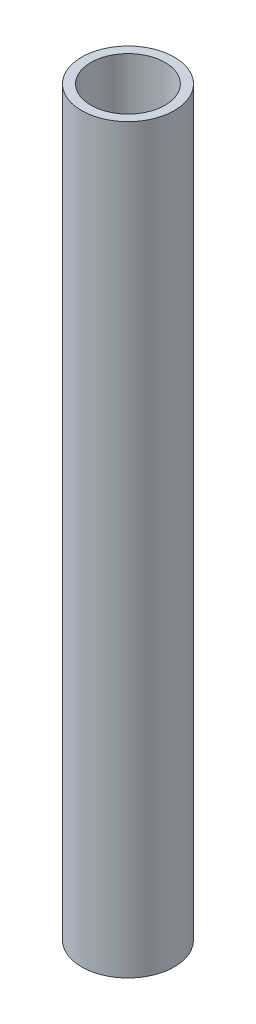
ISO-10303-21;
HEADER;
FILE_DESCRIPTION(('STEP AP214'),'2;1');
FILE_NAME('part.step','',(''),(''),'','','');
FILE_SCHEMA(('AUTOMOTIVE_DESIGN { 1 0 10303 214 1 1 1 1 }'));
ENDSEC;
DATA;
#1=APPLICATION_CONTEXT('core data for automotive mechanical design processes');
#2=APPLICATION_PROTOCOL_DEFINITION('international standard','automotive_design',2000,#1);
#3=PRODUCT_CONTEXT('',#1,'mechanical');
#4=PRODUCT('Part','Part','',(#3));
#5=PRODUCT_RELATED_PRODUCT_CATEGORY('part','',(#4));
#6=PRODUCT_DEFINITION_FORMATION('','',#4);
#7=PRODUCT_DEFINITION_CONTEXT('part definition',#1,'design');
#8=PRODUCT_DEFINITION('design','',#6,#7);
#9=PRODUCT_DEFINITION_SHAPE('','',#8);
#10=(LENGTH_UNIT() NAMED_UNIT(*) SI_UNIT(.MILLI.,.METRE.));
#11=(NAMED_UNIT(*) PLANE_ANGLE_UNIT() SI_UNIT($,.RADIAN.));
#12=(NAMED_UNIT(*) SI_UNIT($,.STERADIAN.) SOLID_ANGLE_UNIT());
#13=UNCERTAINTY_MEASURE_WITH_UNIT(LENGTH_MEASURE(1.E-05),#10,'distance_accuracy_value','');
#14=(GEOMETRIC_REPRESENTATION_CONTEXT(3) GLOBAL_UNCERTAINTY_ASSIGNED_CONTEXT((#13)) GLOBAL_UNIT_ASSIGNED_CONTEXT((#10,
#11,#12)) REPRESENTATION_CONTEXT('',''));
#15=CARTESIAN_POINT('',(0.,0.,0.));
#16=DIRECTION('',(0.,0.,1.));
#17=DIRECTION('',(1.,0.,0.));
#18=AXIS2_PLACEMENT_3D('',#15,#16,#17);
#19=CARTESIAN_POINT('',(0.,40.,0.));
#20=DIRECTION('',(0.,1.,0.));
#21=DIRECTION('',(0.,0.,1.));
#22=AXIS2_PLACEMENT_3D('',#19,#20,#21);
#23=PLANE('',#22);
#24=CARTESIAN_POINT('',(0.,40.,0.));
#25=DIRECTION('',(0.,1.,0.));
#26=DIRECTION('',(0.,0.,1.));
#27=AXIS2_PLACEMENT_3D('',#24,#25,#26);
#28=CIRCLE('',#27,5.);
#29=CARTESIAN_POINT('',(0.,40.,5.));
#30=VERTEX_POINT('',#29);
#31=EDGE_CURVE('E10',#30,#30,#28,.T.);
#32=ORIENTED_EDGE('',*,*,#31,.T.);
#33=EDGE_LOOP('',(#32));
#34=FACE_BOUND('',#33,.T.);
#35=CARTESIAN_POINT('',(0.,40.,0.));
#36=DIRECTION('',(0.,1.,0.));
#37=DIRECTION('',(0.,0.,1.));
#38=AXIS2_PLACEMENT_3D('',#35,#36,#37);
#39=CIRCLE('',#38,4.);
#40=CARTESIAN_POINT('',(0.,40.,4.));
#41=VERTEX_POINT('',#40);
#42=EDGE_CURVE('E42',#41,#41,#39,.T.);
#43=ORIENTED_EDGE('',*,*,#42,.F.);
#44=EDGE_LOOP('',(#43));
#45=FACE_BOUND('',#44,.T.);
#46=ADVANCED_FACE('F31',(#34,#45),#23,.T.);
#47=CARTESIAN_POINT('',(0.,-40.,0.));
#48=DIRECTION('',(0.,1.,0.));
#49=DIRECTION('',(0.,0.,1.));
#50=AXIS2_PLACEMENT_3D('',#47,#48,#49);
#51=PLANE('',#50);
#52=CARTESIAN_POINT('',(0.,-40.,0.));
#53=DIRECTION('',(0.,1.,0.));
#54=DIRECTION('',(0.,0.,1.));
#55=AXIS2_PLACEMENT_3D('',#52,#53,#54);
#56=CIRCLE('',#55,5.);
#57=CARTESIAN_POINT('',(0.,-40.,5.));
#58=VERTEX_POINT('',#57);
#59=EDGE_CURVE('E35',#58,#58,#56,.T.);
#60=ORIENTED_EDGE('',*,*,#59,.F.);
#61=EDGE_LOOP('',(#60));
#62=FACE_BOUND('',#61,.T.);
#63=CARTESIAN_POINT('',(0.,-40.,0.));
#64=DIRECTION('',(0.,1.,0.));
#65=DIRECTION('',(0.,0.,1.));
#66=AXIS2_PLACEMENT_3D('',#63,#64,#65);
#67=CIRCLE('',#66,4.);
#68=CARTESIAN_POINT('',(0.,-40.,4.));
#69=VERTEX_POINT('',#68);
#70=EDGE_CURVE('E44',#69,#69,#67,.T.);
#71=ORIENTED_EDGE('',*,*,#70,.T.);
#72=EDGE_LOOP('',(#71));
#73=FACE_BOUND('',#72,.T.);
#74=ADVANCED_FACE('F54',(#62,#73),#51,.F.);
#75=CARTESIAN_POINT('',(0.,40.,0.));
#76=DIRECTION('',(0.,-1.,0.));
#77=DIRECTION('',(0.,0.,-1.));
#78=AXIS2_PLACEMENT_3D('',#75,#76,#77);
#79=CYLINDRICAL_SURFACE('',#78,5.);
#80=ORIENTED_EDGE('',*,*,#31,.F.);
#81=EDGE_LOOP('',(#80));
#82=FACE_BOUND('',#81,.T.);
#83=ORIENTED_EDGE('',*,*,#59,.T.);
#84=EDGE_LOOP('',(#83));
#85=FACE_BOUND('',#84,.T.);
#86=ADVANCED_FACE('F33',(#82,#85),#79,.T.);
#87=CARTESIAN_POINT('',(0.,40.,0.));
#88=DIRECTION('',(0.,-1.,0.));
#89=DIRECTION('',(0.,0.,-1.));
#90=AXIS2_PLACEMENT_3D('',#87,#88,#89);
#91=CYLINDRICAL_SURFACE('',#90,4.);
#92=ORIENTED_EDGE('',*,*,#42,.T.);
#93=EDGE_LOOP('',(#92));
#94=FACE_BOUND('',#93,.T.);
#95=ORIENTED_EDGE('',*,*,#70,.F.);
#96=EDGE_LOOP('',(#95));
#97=FACE_BOUND('',#96,.T.);
#98=ADVANCED_FACE('F50',(#94,#97),#91,.F.);
#99=CLOSED_SHELL('',(#46,#74,#86,#98));
#100=MANIFOLD_SOLID_BREP('B2',#99);
#101=ADVANCED_BREP_SHAPE_REPRESENTATION('',(#18,#100),#14);
#102=SHAPE_DEFINITION_REPRESENTATION(#9,#101);
ENDSEC;
END-ISO-10303-21;
